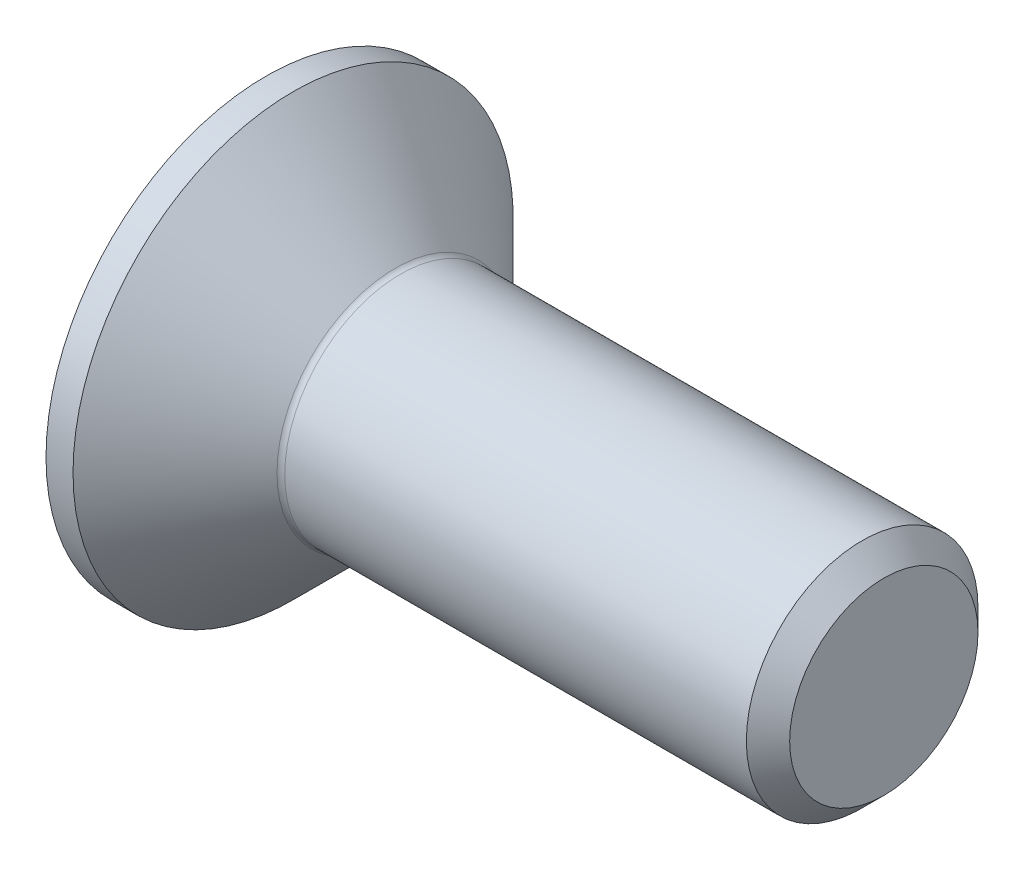
ISO-10303-21;
HEADER;
FILE_DESCRIPTION(('STEP AP214'),'2;1');
FILE_NAME('part.step','',(''),(''),'','','');
FILE_SCHEMA(('AUTOMOTIVE_DESIGN { 1 0 10303 214 1 1 1 1 }'));
ENDSEC;
DATA;
#1=APPLICATION_CONTEXT('core data for automotive mechanical design processes');
#2=APPLICATION_PROTOCOL_DEFINITION('international standard','automotive_design',2000,#1);
#3=PRODUCT_CONTEXT('',#1,'mechanical');
#4=PRODUCT('Part','Part','',(#3));
#5=PRODUCT_RELATED_PRODUCT_CATEGORY('part','',(#4));
#6=PRODUCT_DEFINITION_FORMATION('','',#4);
#7=PRODUCT_DEFINITION_CONTEXT('part definition',#1,'design');
#8=PRODUCT_DEFINITION('design','',#6,#7);
#9=PRODUCT_DEFINITION_SHAPE('','',#8);
#10=(LENGTH_UNIT() NAMED_UNIT(*) SI_UNIT(.MILLI.,.METRE.));
#11=(NAMED_UNIT(*) PLANE_ANGLE_UNIT() SI_UNIT($,.RADIAN.));
#12=(NAMED_UNIT(*) SI_UNIT($,.STERADIAN.) SOLID_ANGLE_UNIT());
#13=UNCERTAINTY_MEASURE_WITH_UNIT(LENGTH_MEASURE(1.E-05),#10,'distance_accuracy_value','');
#14=(GEOMETRIC_REPRESENTATION_CONTEXT(3) GLOBAL_UNCERTAINTY_ASSIGNED_CONTEXT((#13)) GLOBAL_UNIT_ASSIGNED_CONTEXT((#10,
#11,#12)) REPRESENTATION_CONTEXT('',''));
#15=CARTESIAN_POINT('',(0.,0.,0.));
#16=DIRECTION('',(0.,0.,1.));
#17=DIRECTION('',(1.,0.,0.));
#18=AXIS2_PLACEMENT_3D('',#15,#16,#17);
#19=CARTESIAN_POINT('',(0.,0.,0.));
#20=DIRECTION('',(-1.,0.,0.));
#21=DIRECTION('',(0.,0.,1.));
#22=AXIS2_PLACEMENT_3D('',#19,#20,#21);
#23=PLANE('',#22);
#24=CARTESIAN_POINT('',(0.,0.,0.));
#25=DIRECTION('',(-1.,0.,0.));
#26=DIRECTION('',(0.,0.,1.));
#27=AXIS2_PLACEMENT_3D('',#24,#25,#26);
#28=CIRCLE('',#27,2.85);
#29=CARTESIAN_POINT('',(0.,0.,2.85));
#30=VERTEX_POINT('',#29);
#31=EDGE_CURVE('E161',#30,#30,#28,.T.);
#32=ORIENTED_EDGE('',*,*,#31,.T.);
#33=EDGE_LOOP('',(#32));
#34=FACE_BOUND('',#33,.T.);
#35=DIRECTION('',(0.,-0.5,-0.866025403784438));
#36=VECTOR('',#35,1.);
#37=CARTESIAN_POINT('',(0.,-0.583123771881521,1.01));
#38=LINE('',#37,#36);
#39=CARTESIAN_POINT('',(0.,-0.583123771881521,1.01));
#40=VERTEX_POINT('',#39);
#41=CARTESIAN_POINT('',(0.,-1.16624754376304,0.));
#42=VERTEX_POINT('',#41);
#43=EDGE_CURVE('E123',#40,#42,#38,.T.);
#44=ORIENTED_EDGE('',*,*,#43,.T.);
#45=DIRECTION('',(0.,0.5,-0.866025403784438));
#46=VECTOR('',#45,1.);
#47=CARTESIAN_POINT('',(0.,-1.16624754376304,0.));
#48=LINE('',#47,#46);
#49=CARTESIAN_POINT('',(0.,-0.583123771881521,-1.01));
#50=VERTEX_POINT('',#49);
#51=EDGE_CURVE('E53',#42,#50,#48,.T.);
#52=ORIENTED_EDGE('',*,*,#51,.T.);
#53=DIRECTION('',(0.,1.,0.));
#54=VECTOR('',#53,1.);
#55=CARTESIAN_POINT('',(0.,-0.583123771881521,-1.01));
#56=LINE('',#55,#54);
#57=CARTESIAN_POINT('',(0.,0.583123771881523,-1.01));
#58=VERTEX_POINT('',#57);
#59=EDGE_CURVE('E138',#50,#58,#56,.T.);
#60=ORIENTED_EDGE('',*,*,#59,.T.);
#61=DIRECTION('',(0.,0.5,0.866025403784439));
#62=VECTOR('',#61,1.);
#63=CARTESIAN_POINT('',(0.,0.583123771881523,-1.01));
#64=LINE('',#63,#62);
#65=CARTESIAN_POINT('',(0.,1.16624754376305,0.));
#66=VERTEX_POINT('',#65);
#67=EDGE_CURVE('E274',#58,#66,#64,.T.);
#68=ORIENTED_EDGE('',*,*,#67,.T.);
#69=DIRECTION('',(0.,-0.5,0.866025403784439));
#70=VECTOR('',#69,1.);
#71=CARTESIAN_POINT('',(0.,1.16624754376305,0.));
#72=LINE('',#71,#70);
#73=CARTESIAN_POINT('',(0.,0.583123771881523,1.01));
#74=VERTEX_POINT('',#73);
#75=EDGE_CURVE('E277',#66,#74,#72,.T.);
#76=ORIENTED_EDGE('',*,*,#75,.T.);
#77=DIRECTION('',(0.,-1.,0.));
#78=VECTOR('',#77,1.);
#79=CARTESIAN_POINT('',(0.,0.583123771881523,1.01));
#80=LINE('',#79,#78);
#81=EDGE_CURVE('E280',#74,#40,#80,.T.);
#82=ORIENTED_EDGE('',*,*,#81,.T.);
#83=EDGE_LOOP('',(#44,#52,#60,#68,#76,#82));
#84=FACE_BOUND('',#83,.T.);
#85=ADVANCED_FACE('F38',(#34,#84),#23,.T.);
#86=CARTESIAN_POINT('',(0.,0.,0.));
#87=DIRECTION('',(-1.,0.,0.));
#88=DIRECTION('',(0.,0.,1.));
#89=AXIS2_PLACEMENT_3D('',#86,#87,#88);
#90=CYLINDRICAL_SURFACE('',#89,2.85);
#91=CARTESIAN_POINT('',(0.350000000000006,0.,0.));
#92=DIRECTION('',(-1.,0.,0.));
#93=DIRECTION('',(0.,0.,1.));
#94=AXIS2_PLACEMENT_3D('',#91,#92,#93);
#95=CIRCLE('',#94,2.85);
#96=CARTESIAN_POINT('',(0.350000000000006,0.,2.85));
#97=VERTEX_POINT('',#96);
#98=EDGE_CURVE('E158',#97,#97,#95,.T.);
#99=ORIENTED_EDGE('',*,*,#98,.T.);
#100=EDGE_LOOP('',(#99));
#101=FACE_BOUND('',#100,.T.);
#102=ORIENTED_EDGE('',*,*,#31,.F.);
#103=EDGE_LOOP('',(#102));
#104=FACE_BOUND('',#103,.T.);
#105=ADVANCED_FACE('F182',(#101,#104),#90,.T.);
#106=CARTESIAN_POINT('',(0.350000000000006,0.,0.));
#107=DIRECTION('',(-1.,0.,0.));
#108=DIRECTION('',(0.,0.,1.));
#109=AXIS2_PLACEMENT_3D('',#106,#107,#108);
#110=CONICAL_SURFACE('',#109,2.85,0.78539816339745);
#111=CARTESIAN_POINT('',(1.67071067811866,0.,0.));
#112=DIRECTION('',(-1.,0.,0.));
#113=DIRECTION('',(0.,0.,1.));
#114=AXIS2_PLACEMENT_3D('',#111,#112,#113);
#115=CIRCLE('',#114,1.52928932188134);
#116=CARTESIAN_POINT('',(1.67071067811866,0.,1.52928932188134));
#117=VERTEX_POINT('',#116);
#118=EDGE_CURVE('E46',#117,#117,#115,.T.);
#119=ORIENTED_EDGE('',*,*,#118,.T.);
#120=EDGE_LOOP('',(#119));
#121=FACE_BOUND('',#120,.T.);
#122=ORIENTED_EDGE('',*,*,#98,.F.);
#123=EDGE_LOOP('',(#122));
#124=FACE_BOUND('',#123,.T.);
#125=ADVANCED_FACE('F166',(#121,#124),#110,.T.);
#126=CARTESIAN_POINT('',(0.,0.,0.));
#127=DIRECTION('',(-1.,0.,0.));
#128=DIRECTION('',(0.,0.,1.));
#129=AXIS2_PLACEMENT_3D('',#126,#127,#128);
#130=CYLINDRICAL_SURFACE('',#129,1.5);
#131=CARTESIAN_POINT('',(1.74142135623731,0.,0.));
#132=DIRECTION('',(-1.,0.,0.));
#133=DIRECTION('',(0.,0.,1.));
#134=AXIS2_PLACEMENT_3D('',#131,#132,#133);
#135=CIRCLE('',#134,1.5);
#136=CARTESIAN_POINT('',(1.74142135623731,0.,1.5));
#137=VERTEX_POINT('',#136);
#138=EDGE_CURVE('E11',#137,#137,#135,.F.);
#139=ORIENTED_EDGE('',*,*,#138,.T.);
#140=EDGE_LOOP('',(#139));
#141=FACE_BOUND('',#140,.T.);
#142=CARTESIAN_POINT('',(7.7195,0.,0.));
#143=DIRECTION('',(-1.,0.,0.));
#144=DIRECTION('',(0.,0.,1.));
#145=AXIS2_PLACEMENT_3D('',#142,#143,#144);
#146=CIRCLE('',#145,1.49999999999999);
#147=CARTESIAN_POINT('',(7.7195,0.,1.49999999999999));
#148=VERTEX_POINT('',#147);
#149=EDGE_CURVE('E155',#148,#148,#146,.T.);
#150=ORIENTED_EDGE('',*,*,#149,.T.);
#151=EDGE_LOOP('',(#150));
#152=FACE_BOUND('',#151,.T.);
#153=ADVANCED_FACE('F193',(#141,#152),#130,.T.);
#154=CARTESIAN_POINT('',(8.,0.,0.));
#155=DIRECTION('',(-1.,0.,0.));
#156=DIRECTION('',(0.,0.,1.));
#157=AXIS2_PLACEMENT_3D('',#154,#155,#156);
#158=CONICAL_SURFACE('',#157,1.2195,0.785398163397434);
#159=ORIENTED_EDGE('',*,*,#149,.F.);
#160=EDGE_LOOP('',(#159));
#161=FACE_BOUND('',#160,.T.);
#162=CARTESIAN_POINT('',(8.,0.,0.));
#163=DIRECTION('',(-1.,0.,0.));
#164=DIRECTION('',(0.,0.,1.));
#165=AXIS2_PLACEMENT_3D('',#162,#163,#164);
#166=CIRCLE('',#165,1.2195);
#167=CARTESIAN_POINT('',(8.,0.,1.2195));
#168=VERTEX_POINT('',#167);
#169=EDGE_CURVE('E151',#168,#168,#166,.T.);
#170=ORIENTED_EDGE('',*,*,#169,.T.);
#171=EDGE_LOOP('',(#170));
#172=FACE_BOUND('',#171,.T.);
#173=ADVANCED_FACE('F177',(#161,#172),#158,.T.);
#174=CARTESIAN_POINT('',(8.,1.2195,0.));
#175=DIRECTION('',(1.,0.,0.));
#176=DIRECTION('',(0.,0.,-1.));
#177=AXIS2_PLACEMENT_3D('',#174,#175,#176);
#178=PLANE('',#177);
#179=ORIENTED_EDGE('',*,*,#169,.F.);
#180=EDGE_LOOP('',(#179));
#181=FACE_BOUND('',#180,.T.);
#182=ADVANCED_FACE('F170',(#181),#178,.T.);
#183=CARTESIAN_POINT('',(1.74142135623731,0.,0.));
#184=DIRECTION('',(-1.,0.,0.));
#185=DIRECTION('',(0.,0.,1.));
#186=AXIS2_PLACEMENT_3D('',#183,#184,#185);
#187=TOROIDAL_SURFACE('',#186,1.6,0.1);
#188=ORIENTED_EDGE('',*,*,#138,.F.);
#189=EDGE_LOOP('',(#188));
#190=FACE_BOUND('',#189,.T.);
#191=ORIENTED_EDGE('',*,*,#118,.F.);
#192=EDGE_LOOP('',(#191));
#193=FACE_BOUND('',#192,.T.);
#194=ADVANCED_FACE('F40',(#190,#193),#187,.F.);
#195=CARTESIAN_POINT('',(1.2,-1.16624754376304,0.));
#196=DIRECTION('',(0.,0.866025403784438,0.5));
#197=DIRECTION('',(0.,-0.5,0.866025403784439));
#198=AXIS2_PLACEMENT_3D('',#195,#196,#197);
#199=PLANE('',#198);
#200=ORIENTED_EDGE('',*,*,#51,.F.);
#201=DIRECTION('',(-1.,0.,0.));
#202=VECTOR('',#201,1.);
#203=CARTESIAN_POINT('',(1.2,-1.16624754376304,0.));
#204=LINE('',#203,#202);
#205=CARTESIAN_POINT('',(1.2,-1.16624754376304,0.));
#206=VERTEX_POINT('',#205);
#207=EDGE_CURVE('E271',#206,#42,#204,.T.);
#208=ORIENTED_EDGE('',*,*,#207,.F.);
#209=DIRECTION('',(0.,0.5,-0.866025403784438));
#210=VECTOR('',#209,1.);
#211=CARTESIAN_POINT('',(1.2,-1.16624754376304,0.));
#212=LINE('',#211,#210);
#213=CARTESIAN_POINT('',(1.2,-0.874685657822282,-0.505));
#214=VERTEX_POINT('',#213);
#215=EDGE_CURVE('E120',#206,#214,#212,.T.);
#216=ORIENTED_EDGE('',*,*,#215,.T.);
#217=CARTESIAN_POINT('',(1.2,-0.583123771881521,-1.01));
#218=VERTEX_POINT('',#217);
#219=EDGE_CURVE('E114',#214,#218,#212,.T.);
#220=ORIENTED_EDGE('',*,*,#219,.T.);
#221=DIRECTION('',(-1.,0.,0.));
#222=VECTOR('',#221,1.);
#223=CARTESIAN_POINT('',(1.2,-0.583123771881521,-1.01));
#224=LINE('',#223,#222);
#225=EDGE_CURVE('E118',#218,#50,#224,.T.);
#226=ORIENTED_EDGE('',*,*,#225,.T.);
#227=EDGE_LOOP('',(#200,#208,#216,#220,#226));
#228=FACE_BOUND('',#227,.T.);
#229=ADVANCED_FACE('F116',(#228),#199,.T.);
#230=CARTESIAN_POINT('',(1.2,-0.583123771881521,-1.01));
#231=DIRECTION('',(0.,0.,1.));
#232=DIRECTION('',(1.,0.,0.));
#233=AXIS2_PLACEMENT_3D('',#230,#231,#232);
#234=PLANE('',#233);
#235=ORIENTED_EDGE('',*,*,#59,.F.);
#236=ORIENTED_EDGE('',*,*,#225,.F.);
#237=DIRECTION('',(0.,1.,0.));
#238=VECTOR('',#237,1.);
#239=CARTESIAN_POINT('',(1.2,-0.583123771881521,-1.01));
#240=LINE('',#239,#238);
#241=CARTESIAN_POINT('',(1.2,0.,-1.01));
#242=VERTEX_POINT('',#241);
#243=EDGE_CURVE('E126',#218,#242,#240,.T.);
#244=ORIENTED_EDGE('',*,*,#243,.T.);
#245=CARTESIAN_POINT('',(1.2,0.583123771881523,-1.01));
#246=VERTEX_POINT('',#245);
#247=EDGE_CURVE('E133',#242,#246,#240,.T.);
#248=ORIENTED_EDGE('',*,*,#247,.T.);
#249=DIRECTION('',(-1.,0.,0.));
#250=VECTOR('',#249,1.);
#251=CARTESIAN_POINT('',(1.2,0.583123771881523,-1.01));
#252=LINE('',#251,#250);
#253=EDGE_CURVE('E140',#246,#58,#252,.T.);
#254=ORIENTED_EDGE('',*,*,#253,.T.);
#255=EDGE_LOOP('',(#235,#236,#244,#248,#254));
#256=FACE_BOUND('',#255,.T.);
#257=ADVANCED_FACE('F135',(#256),#234,.T.);
#258=CARTESIAN_POINT('',(1.2,0.583123771881523,-1.01));
#259=DIRECTION('',(0.,-0.866025403784439,0.5));
#260=DIRECTION('',(0.,-0.5,-0.866025403784439));
#261=AXIS2_PLACEMENT_3D('',#258,#259,#260);
#262=PLANE('',#261);
#263=ORIENTED_EDGE('',*,*,#67,.F.);
#264=ORIENTED_EDGE('',*,*,#253,.F.);
#265=DIRECTION('',(0.,0.5,0.866025403784439));
#266=VECTOR('',#265,1.);
#267=CARTESIAN_POINT('',(1.2,0.583123771881523,-1.01));
#268=LINE('',#267,#266);
#269=CARTESIAN_POINT('',(1.2,0.874685657822284,-0.505));
#270=VERTEX_POINT('',#269);
#271=EDGE_CURVE('E263',#246,#270,#268,.T.);
#272=ORIENTED_EDGE('',*,*,#271,.T.);
#273=CARTESIAN_POINT('',(1.2,1.16624754376305,0.));
#274=VERTEX_POINT('',#273);
#275=EDGE_CURVE('E132',#270,#274,#268,.T.);
#276=ORIENTED_EDGE('',*,*,#275,.T.);
#277=DIRECTION('',(-1.,0.,0.));
#278=VECTOR('',#277,1.);
#279=CARTESIAN_POINT('',(1.2,1.16624754376305,0.));
#280=LINE('',#279,#278);
#281=EDGE_CURVE('E146',#274,#66,#280,.T.);
#282=ORIENTED_EDGE('',*,*,#281,.T.);
#283=EDGE_LOOP('',(#263,#264,#272,#276,#282));
#284=FACE_BOUND('',#283,.T.);
#285=ADVANCED_FACE('F207',(#284),#262,.T.);
#286=CARTESIAN_POINT('',(1.2,1.16624754376305,0.));
#287=DIRECTION('',(0.,-0.866025403784439,-0.5));
#288=DIRECTION('',(0.,0.5,-0.866025403784439));
#289=AXIS2_PLACEMENT_3D('',#286,#287,#288);
#290=PLANE('',#289);
#291=ORIENTED_EDGE('',*,*,#75,.F.);
#292=ORIENTED_EDGE('',*,*,#281,.F.);
#293=DIRECTION('',(0.,-0.5,0.866025403784439));
#294=VECTOR('',#293,1.);
#295=CARTESIAN_POINT('',(1.2,1.16624754376305,0.));
#296=LINE('',#295,#294);
#297=CARTESIAN_POINT('',(1.2,0.874685657822283,0.505));
#298=VERTEX_POINT('',#297);
#299=EDGE_CURVE('E61',#274,#298,#296,.T.);
#300=ORIENTED_EDGE('',*,*,#299,.T.);
#301=CARTESIAN_POINT('',(1.2,0.583123771881523,1.01));
#302=VERTEX_POINT('',#301);
#303=EDGE_CURVE('E242',#298,#302,#296,.T.);
#304=ORIENTED_EDGE('',*,*,#303,.T.);
#305=DIRECTION('',(-1.,0.,0.));
#306=VECTOR('',#305,1.);
#307=CARTESIAN_POINT('',(1.2,0.583123771881523,1.01));
#308=LINE('',#307,#306);
#309=EDGE_CURVE('E256',#302,#74,#308,.T.);
#310=ORIENTED_EDGE('',*,*,#309,.T.);
#311=EDGE_LOOP('',(#291,#292,#300,#304,#310));
#312=FACE_BOUND('',#311,.T.);
#313=ADVANCED_FACE('F210',(#312),#290,.T.);
#314=CARTESIAN_POINT('',(1.2,0.583123771881523,1.01));
#315=DIRECTION('',(0.,0.,-1.));
#316=DIRECTION('',(-1.,0.,0.));
#317=AXIS2_PLACEMENT_3D('',#314,#315,#316);
#318=PLANE('',#317);
#319=ORIENTED_EDGE('',*,*,#81,.F.);
#320=ORIENTED_EDGE('',*,*,#309,.F.);
#321=DIRECTION('',(0.,-1.,0.));
#322=VECTOR('',#321,1.);
#323=CARTESIAN_POINT('',(1.2,0.583123771881523,1.01));
#324=LINE('',#323,#322);
#325=CARTESIAN_POINT('',(1.2,0.,1.01));
#326=VERTEX_POINT('',#325);
#327=EDGE_CURVE('E241',#302,#326,#324,.T.);
#328=ORIENTED_EDGE('',*,*,#327,.T.);
#329=CARTESIAN_POINT('',(1.2,-0.583123771881521,1.01));
#330=VERTEX_POINT('',#329);
#331=EDGE_CURVE('E247',#326,#330,#324,.T.);
#332=ORIENTED_EDGE('',*,*,#331,.T.);
#333=DIRECTION('',(-1.,0.,0.));
#334=VECTOR('',#333,1.);
#335=CARTESIAN_POINT('',(1.2,-0.583123771881521,1.01));
#336=LINE('',#335,#334);
#337=EDGE_CURVE('E286',#330,#40,#336,.T.);
#338=ORIENTED_EDGE('',*,*,#337,.T.);
#339=EDGE_LOOP('',(#319,#320,#328,#332,#338));
#340=FACE_BOUND('',#339,.T.);
#341=ADVANCED_FACE('F214',(#340),#318,.T.);
#342=CARTESIAN_POINT('',(1.2,-0.583123771881521,1.01));
#343=DIRECTION('',(0.,0.866025403784438,-0.5));
#344=DIRECTION('',(0.,0.5,0.866025403784439));
#345=AXIS2_PLACEMENT_3D('',#342,#343,#344);
#346=PLANE('',#345);
#347=ORIENTED_EDGE('',*,*,#43,.F.);
#348=ORIENTED_EDGE('',*,*,#337,.F.);
#349=DIRECTION('',(0.,-0.5,-0.866025403784438));
#350=VECTOR('',#349,1.);
#351=CARTESIAN_POINT('',(1.2,-0.583123771881521,1.01));
#352=LINE('',#351,#350);
#353=CARTESIAN_POINT('',(1.2,-0.874685657822282,0.505));
#354=VERTEX_POINT('',#353);
#355=EDGE_CURVE('E250',#330,#354,#352,.T.);
#356=ORIENTED_EDGE('',*,*,#355,.T.);
#357=EDGE_CURVE('E257',#354,#206,#352,.T.);
#358=ORIENTED_EDGE('',*,*,#357,.T.);
#359=ORIENTED_EDGE('',*,*,#207,.T.);
#360=EDGE_LOOP('',(#347,#348,#356,#358,#359));
#361=FACE_BOUND('',#360,.T.);
#362=ADVANCED_FACE('F217',(#361),#346,.T.);
#363=CARTESIAN_POINT('',(1.2,-1.16624754376304,0.));
#364=DIRECTION('',(-1.,0.,0.));
#365=DIRECTION('',(0.,0.,1.));
#366=AXIS2_PLACEMENT_3D('',#363,#364,#365);
#367=PLANE('',#366);
#368=CARTESIAN_POINT('',(1.2,0.,0.));
#369=DIRECTION('',(-1.,0.,0.));
#370=DIRECTION('',(0.,0.,1.));
#371=AXIS2_PLACEMENT_3D('',#368,#369,#370);
#372=CIRCLE('',#371,1.01);
#373=EDGE_CURVE('E139',#354,#326,#372,.T.);
#374=ORIENTED_EDGE('',*,*,#373,.F.);
#375=ORIENTED_EDGE('',*,*,#355,.F.);
#376=ORIENTED_EDGE('',*,*,#331,.F.);
#377=EDGE_LOOP('',(#374,#375,#376));
#378=FACE_BOUND('',#377,.T.);
#379=ADVANCED_FACE('F221',(#378),#367,.T.);
#380=EDGE_CURVE('E143',#214,#354,#372,.T.);
#381=ORIENTED_EDGE('',*,*,#380,.F.);
#382=ORIENTED_EDGE('',*,*,#215,.F.);
#383=ORIENTED_EDGE('',*,*,#357,.F.);
#384=EDGE_LOOP('',(#381,#382,#383));
#385=FACE_BOUND('',#384,.T.);
#386=ADVANCED_FACE('F224',(#385),#367,.T.);
#387=EDGE_CURVE('E128',#242,#214,#372,.T.);
#388=ORIENTED_EDGE('',*,*,#387,.F.);
#389=ORIENTED_EDGE('',*,*,#243,.F.);
#390=ORIENTED_EDGE('',*,*,#219,.F.);
#391=EDGE_LOOP('',(#388,#389,#390));
#392=FACE_BOUND('',#391,.T.);
#393=ADVANCED_FACE('F127',(#392),#367,.T.);
#394=EDGE_CURVE('E259',#270,#242,#372,.T.);
#395=ORIENTED_EDGE('',*,*,#394,.F.);
#396=ORIENTED_EDGE('',*,*,#271,.F.);
#397=ORIENTED_EDGE('',*,*,#247,.F.);
#398=EDGE_LOOP('',(#395,#396,#397));
#399=FACE_BOUND('',#398,.T.);
#400=ADVANCED_FACE('F236',(#399),#367,.T.);
#401=EDGE_CURVE('E152',#298,#270,#372,.T.);
#402=ORIENTED_EDGE('',*,*,#401,.F.);
#403=ORIENTED_EDGE('',*,*,#299,.F.);
#404=ORIENTED_EDGE('',*,*,#275,.F.);
#405=EDGE_LOOP('',(#402,#403,#404));
#406=FACE_BOUND('',#405,.T.);
#407=ADVANCED_FACE('F231',(#406),#367,.T.);
#408=EDGE_CURVE('E145',#326,#298,#372,.T.);
#409=ORIENTED_EDGE('',*,*,#408,.F.);
#410=ORIENTED_EDGE('',*,*,#327,.F.);
#411=ORIENTED_EDGE('',*,*,#303,.F.);
#412=EDGE_LOOP('',(#409,#410,#411));
#413=FACE_BOUND('',#412,.T.);
#414=ADVANCED_FACE('F202',(#413),#367,.T.);
#415=CARTESIAN_POINT('',(1.2,0.,0.));
#416=DIRECTION('',(-1.,0.,0.));
#417=DIRECTION('',(0.,0.,1.));
#418=AXIS2_PLACEMENT_3D('',#415,#416,#417);
#419=CONICAL_SURFACE('',#418,1.01,1.04719755119659);
#420=CARTESIAN_POINT('',(1.78312377188153,0.,0.));
#421=VERTEX_POINT('',#420);
#422=VERTEX_LOOP('',#421);
#423=FACE_BOUND('',#422,.T.);
#424=ORIENTED_EDGE('',*,*,#408,.T.);
#425=ORIENTED_EDGE('',*,*,#401,.T.);
#426=ORIENTED_EDGE('',*,*,#394,.T.);
#427=ORIENTED_EDGE('',*,*,#387,.T.);
#428=ORIENTED_EDGE('',*,*,#380,.T.);
#429=ORIENTED_EDGE('',*,*,#373,.T.);
#430=EDGE_LOOP('',(#424,#425,#426,#427,#428,#429));
#431=FACE_BOUND('',#430,.T.);
#432=ADVANCED_FACE('F200',(#423,#431),#419,.F.);
#433=CLOSED_SHELL('',(#85,#105,#125,#153,#173,#182,#194,#229,#257,#285,#313,#341,#362,#379,#386,
#393,#400,#407,#414,#432));
#434=MANIFOLD_SOLID_BREP('B2',#433);
#435=ADVANCED_BREP_SHAPE_REPRESENTATION('',(#18,#434),#14);
#436=SHAPE_DEFINITION_REPRESENTATION(#9,#435);
ENDSEC;
END-ISO-10303-21;
